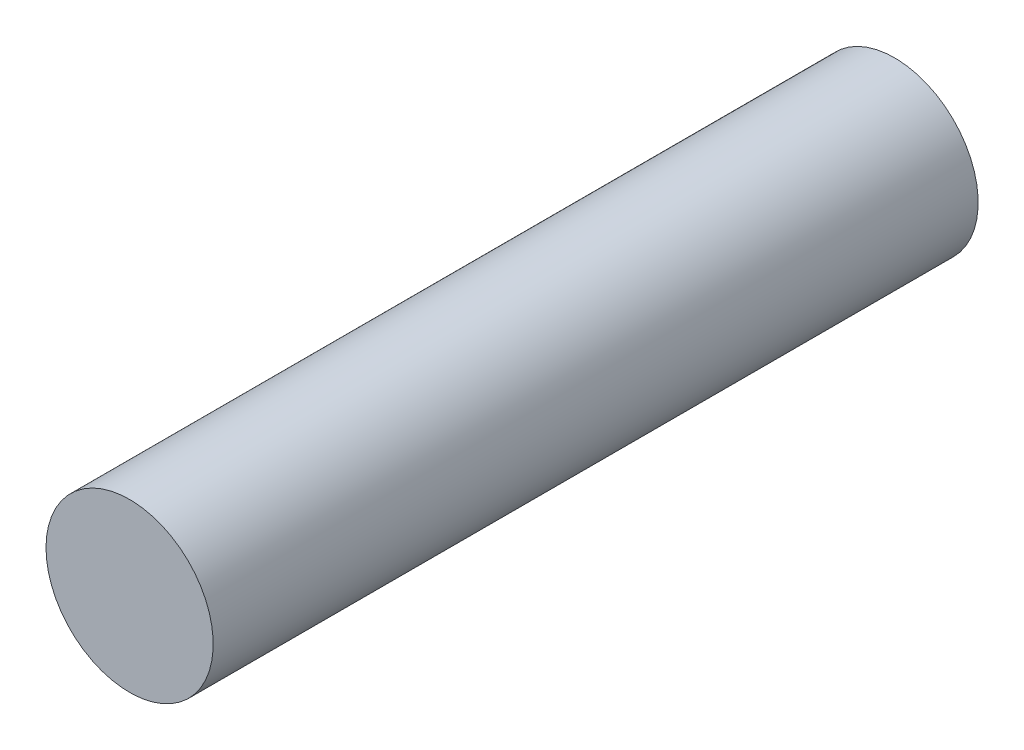
ISO-10303-21;
HEADER;
FILE_DESCRIPTION(('STEP AP214'),'2;1');
FILE_NAME('part.step','',(''),(''),'','','');
FILE_SCHEMA(('AUTOMOTIVE_DESIGN { 1 0 10303 214 1 1 1 1 }'));
ENDSEC;
DATA;
#1=APPLICATION_CONTEXT('core data for automotive mechanical design processes');
#2=APPLICATION_PROTOCOL_DEFINITION('international standard','automotive_design',2000,#1);
#3=PRODUCT_CONTEXT('',#1,'mechanical');
#4=PRODUCT('Part','Part','',(#3));
#5=PRODUCT_RELATED_PRODUCT_CATEGORY('part','',(#4));
#6=PRODUCT_DEFINITION_FORMATION('','',#4);
#7=PRODUCT_DEFINITION_CONTEXT('part definition',#1,'design');
#8=PRODUCT_DEFINITION('design','',#6,#7);
#9=PRODUCT_DEFINITION_SHAPE('','',#8);
#10=(LENGTH_UNIT() NAMED_UNIT(*) SI_UNIT(.MILLI.,.METRE.));
#11=(NAMED_UNIT(*) PLANE_ANGLE_UNIT() SI_UNIT($,.RADIAN.));
#12=(NAMED_UNIT(*) SI_UNIT($,.STERADIAN.) SOLID_ANGLE_UNIT());
#13=UNCERTAINTY_MEASURE_WITH_UNIT(LENGTH_MEASURE(1.E-05),#10,'distance_accuracy_value','');
#14=(GEOMETRIC_REPRESENTATION_CONTEXT(3) GLOBAL_UNCERTAINTY_ASSIGNED_CONTEXT((#13)) GLOBAL_UNIT_ASSIGNED_CONTEXT((#10,
#11,#12)) REPRESENTATION_CONTEXT('',''));
#15=CARTESIAN_POINT('',(0.,0.,0.));
#16=DIRECTION('',(0.,0.,1.));
#17=DIRECTION('',(1.,0.,0.));
#18=AXIS2_PLACEMENT_3D('',#15,#16,#17);
#19=CARTESIAN_POINT('',(0.,0.,9.15));
#20=DIRECTION('',(0.,0.,1.));
#21=DIRECTION('',(1.,0.,0.));
#22=AXIS2_PLACEMENT_3D('',#19,#20,#21);
#23=PLANE('',#22);
#24=CARTESIAN_POINT('',(0.,0.,9.15));
#25=DIRECTION('',(0.,0.,-1.));
#26=DIRECTION('',(-1.,0.,0.));
#27=AXIS2_PLACEMENT_3D('',#24,#25,#26);
#28=CIRCLE('',#27,1.);
#29=CARTESIAN_POINT('',(-1.,0.,9.15));
#30=VERTEX_POINT('',#29);
#31=EDGE_CURVE('E18',#30,#30,#28,.T.);
#32=ORIENTED_EDGE('',*,*,#31,.F.);
#33=EDGE_LOOP('',(#32));
#34=FACE_BOUND('',#33,.T.);
#35=ADVANCED_FACE('F15',(#34),#23,.T.);
#36=CARTESIAN_POINT('',(0.,0.,0.));
#37=DIRECTION('',(0.,0.,1.));
#38=DIRECTION('',(1.,0.,0.));
#39=AXIS2_PLACEMENT_3D('',#36,#37,#38);
#40=PLANE('',#39);
#41=CARTESIAN_POINT('',(0.,0.,0.));
#42=DIRECTION('',(0.,0.,-1.));
#43=DIRECTION('',(-1.,0.,0.));
#44=AXIS2_PLACEMENT_3D('',#41,#42,#43);
#45=CIRCLE('',#44,1.);
#46=CARTESIAN_POINT('',(-1.,0.,0.));
#47=VERTEX_POINT('',#46);
#48=EDGE_CURVE('E10',#47,#47,#45,.F.);
#49=ORIENTED_EDGE('',*,*,#48,.F.);
#50=EDGE_LOOP('',(#49));
#51=FACE_BOUND('',#50,.T.);
#52=ADVANCED_FACE('F30',(#51),#40,.F.);
#53=CARTESIAN_POINT('',(0.,0.,9.15));
#54=DIRECTION('',(0.,0.,-1.));
#55=DIRECTION('',(-1.,0.,0.));
#56=AXIS2_PLACEMENT_3D('',#53,#54,#55);
#57=CYLINDRICAL_SURFACE('',#56,1.);
#58=ORIENTED_EDGE('',*,*,#48,.T.);
#59=EDGE_LOOP('',(#58));
#60=FACE_BOUND('',#59,.T.);
#61=ORIENTED_EDGE('',*,*,#31,.T.);
#62=EDGE_LOOP('',(#61));
#63=FACE_BOUND('',#62,.T.);
#64=ADVANCED_FACE('F27',(#60,#63),#57,.T.);
#65=CLOSED_SHELL('',(#35,#52,#64));
#66=MANIFOLD_SOLID_BREP('B1',#65);
#67=ADVANCED_BREP_SHAPE_REPRESENTATION('',(#18,#66),#14);
#68=SHAPE_DEFINITION_REPRESENTATION(#9,#67);
ENDSEC;
END-ISO-10303-21;
